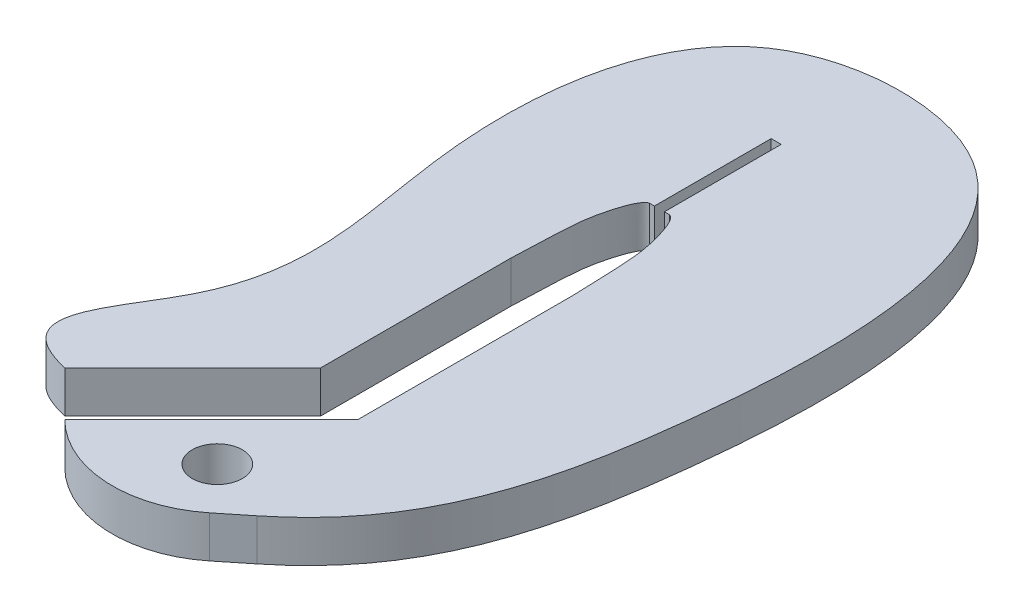
ISO-10303-21;
HEADER;
FILE_DESCRIPTION(('STEP AP214'),'2;1');
FILE_NAME('part.step','',(''),(''),'','','');
FILE_SCHEMA(('AUTOMOTIVE_DESIGN { 1 0 10303 214 1 1 1 1 }'));
ENDSEC;
DATA;
#1=APPLICATION_CONTEXT('core data for automotive mechanical design processes');
#2=APPLICATION_PROTOCOL_DEFINITION('international standard','automotive_design',2000,#1);
#3=PRODUCT_CONTEXT('',#1,'mechanical');
#4=PRODUCT('Part','Part','',(#3));
#5=PRODUCT_RELATED_PRODUCT_CATEGORY('part','',(#4));
#6=PRODUCT_DEFINITION_FORMATION('','',#4);
#7=PRODUCT_DEFINITION_CONTEXT('part definition',#1,'design');
#8=PRODUCT_DEFINITION('design','',#6,#7);
#9=PRODUCT_DEFINITION_SHAPE('','',#8);
#10=(LENGTH_UNIT() NAMED_UNIT(*) SI_UNIT(.MILLI.,.METRE.));
#11=(NAMED_UNIT(*) PLANE_ANGLE_UNIT() SI_UNIT($,.RADIAN.));
#12=(NAMED_UNIT(*) SI_UNIT($,.STERADIAN.) SOLID_ANGLE_UNIT());
#13=UNCERTAINTY_MEASURE_WITH_UNIT(LENGTH_MEASURE(1.E-05),#10,'distance_accuracy_value','');
#14=(GEOMETRIC_REPRESENTATION_CONTEXT(3) GLOBAL_UNCERTAINTY_ASSIGNED_CONTEXT((#13)) GLOBAL_UNIT_ASSIGNED_CONTEXT((#10,
#11,#12)) REPRESENTATION_CONTEXT('',''));
#15=CARTESIAN_POINT('',(0.,0.,0.));
#16=DIRECTION('',(0.,0.,1.));
#17=DIRECTION('',(1.,0.,0.));
#18=AXIS2_PLACEMENT_3D('',#15,#16,#17);
#19=CARTESIAN_POINT('',(4.52631083074093,2.5,-32.3138557168903));
#20=DIRECTION('',(0.,-1.,0.));
#21=DIRECTION('',(0.,0.,-1.));
#22=AXIS2_PLACEMENT_3D('',#19,#20,#21);
#23=PLANE('',#22);
#24=CARTESIAN_POINT('',(6.36765924011729,2.5,8.99126136659441));
#25=CARTESIAN_POINT('',(8.33592128594081,2.5,7.41052972888379));
#26=CARTESIAN_POINT('',(12.4422864625777,2.5,2.47581603232794));
#27=CARTESIAN_POINT('',(15.2743284521628,2.5,-11.3720785952308));
#28=CARTESIAN_POINT('',(15.3995850689258,2.5,-33.1916811091714));
#29=CARTESIAN_POINT('',(-6.20231168166281,2.5,-32.4691182728249));
#30=CARTESIAN_POINT('',(-8.06896636052285,2.5,-15.0563166698078));
#31=CARTESIAN_POINT('',(-3.37106080697065,2.5,-2.76640861666073));
#32=CARTESIAN_POINT('',(-12.0212916162128,2.5,5.93283563216519));
#33=CARTESIAN_POINT('',(-7.07106781186551,2.5,7.07106781186547));
#34=B_SPLINE_CURVE_WITH_KNOTS('',3,(#24,#25,#26,#27,#28,#29,#30,#31,#32,#33),.UNSPECIFIED.,.F.,
.F.,(4,1,1,1,1,1,1,4),(0.0116284680882621,0.0818777860571435,0.220720336560713,
0.462998596925492,0.579337122233019,0.740821042009564,0.900192675539681,1.),.UNSPECIFIED.);
#35=CARTESIAN_POINT('',(6.36765924011806,2.5,8.99126136659412));
#36=VERTEX_POINT('',#35);
#37=CARTESIAN_POINT('',(-7.07106781186547,2.5,7.07106781186547));
#38=VERTEX_POINT('',#37);
#39=EDGE_CURVE('E209',#36,#38,#34,.T.);
#40=ORIENTED_EDGE('',*,*,#39,.T.);
#41=DIRECTION('',(0.707106781186548,0.,-0.707106781186548));
#42=VECTOR('',#41,1.);
#43=CARTESIAN_POINT('',(0.6,2.5,-0.6));
#44=LINE('',#43,#42);
#45=CARTESIAN_POINT('',(0.6,2.5,-0.6));
#46=VERTEX_POINT('',#45);
#47=EDGE_CURVE('E112',#38,#46,#44,.T.);
#48=ORIENTED_EDGE('',*,*,#47,.T.);
#49=DIRECTION('',(0.,0.,-1.));
#50=VECTOR('',#49,1.);
#51=CARTESIAN_POINT('',(0.6,2.5,-0.6));
#52=LINE('',#51,#50);
#53=CARTESIAN_POINT('',(0.6,2.5,-12.));
#54=VERTEX_POINT('',#53);
#55=EDGE_CURVE('E242',#46,#54,#52,.T.);
#56=ORIENTED_EDGE('',*,*,#55,.T.);
#57=CARTESIAN_POINT('',(0.6,2.5,-12.));
#58=CARTESIAN_POINT('',(0.705879385478123,2.5,-15.5317289947273));
#59=CARTESIAN_POINT('',(0.830348083774037,2.5,-16.2001089021));
#60=CARTESIAN_POINT('',(0.963303184907785,2.5,-16.9797649874549));
#61=CARTESIAN_POINT('',(1.42899004008316,2.5,-18.8963341287148));
#62=CARTESIAN_POINT('',(1.9,2.5,-19.));
#63=B_SPLINE_CURVE_WITH_KNOTS('',3,(#57,#58,#59,#60,#61,#62),.UNSPECIFIED.,.F.,.F.,(4,1,1,4),
(0.,0.421520607833675,0.521520607833675,1.),.UNSPECIFIED.);
#64=CARTESIAN_POINT('',(1.9,2.5,-19.));
#65=VERTEX_POINT('',#64);
#66=EDGE_CURVE('E261',#54,#65,#63,.T.);
#67=ORIENTED_EDGE('',*,*,#66,.T.);
#68=DIRECTION('',(1.,0.,0.));
#69=VECTOR('',#68,1.);
#70=CARTESIAN_POINT('',(1.9,2.5,-19.));
#71=LINE('',#70,#69);
#72=CARTESIAN_POINT('',(2.2,2.5,-19.));
#73=VERTEX_POINT('',#72);
#74=EDGE_CURVE('E258',#65,#73,#71,.T.);
#75=ORIENTED_EDGE('',*,*,#74,.T.);
#76=DIRECTION('',(0.,0.,-1.));
#77=VECTOR('',#76,1.);
#78=CARTESIAN_POINT('',(2.2,2.5,-19.));
#79=LINE('',#78,#77);
#80=CARTESIAN_POINT('',(2.2,2.5,-26.));
#81=VERTEX_POINT('',#80);
#82=EDGE_CURVE('E260',#73,#81,#79,.T.);
#83=ORIENTED_EDGE('',*,*,#82,.T.);
#84=DIRECTION('',(1.,0.,0.));
#85=VECTOR('',#84,1.);
#86=CARTESIAN_POINT('',(2.2,2.5,-26.));
#87=LINE('',#86,#85);
#88=CARTESIAN_POINT('',(2.8,2.5,-26.));
#89=VERTEX_POINT('',#88);
#90=EDGE_CURVE('E263',#81,#89,#87,.T.);
#91=ORIENTED_EDGE('',*,*,#90,.T.);
#92=DIRECTION('',(0.,0.,1.));
#93=VECTOR('',#92,1.);
#94=CARTESIAN_POINT('',(2.8,2.5,-19.));
#95=LINE('',#94,#93);
#96=CARTESIAN_POINT('',(2.8,2.5,-19.));
#97=VERTEX_POINT('',#96);
#98=EDGE_CURVE('E272',#89,#97,#95,.T.);
#99=ORIENTED_EDGE('',*,*,#98,.T.);
#100=DIRECTION('',(1.,0.,0.));
#101=VECTOR('',#100,1.);
#102=CARTESIAN_POINT('',(2.8,2.5,-19.));
#103=LINE('',#102,#101);
#104=CARTESIAN_POINT('',(3.1,2.5,-19.));
#105=VERTEX_POINT('',#104);
#106=EDGE_CURVE('E274',#97,#105,#103,.T.);
#107=ORIENTED_EDGE('',*,*,#106,.T.);
#108=CARTESIAN_POINT('',(3.1,2.5,-19.));
#109=CARTESIAN_POINT('',(3.57100995991684,2.5,-18.8963341287148));
#110=CARTESIAN_POINT('',(4.03669681509221,2.5,-16.9797649874549));
#111=CARTESIAN_POINT('',(4.16965191622597,2.5,-16.2001089021));
#112=CARTESIAN_POINT('',(4.29412061452188,2.5,-15.5317289947273));
#113=CARTESIAN_POINT('',(4.4,2.5,-12.));
#114=B_SPLINE_CURVE_WITH_KNOTS('',3,(#108,#109,#110,#111,#112,#113),.UNSPECIFIED.,.F.,.F.,(4,1,
1,4),(0.,0.478479392166325,0.578479392166325,1.),.UNSPECIFIED.);
#115=CARTESIAN_POINT('',(4.4,2.5,-12.));
#116=VERTEX_POINT('',#115);
#117=EDGE_CURVE('E276',#105,#116,#114,.T.);
#118=ORIENTED_EDGE('',*,*,#117,.T.);
#119=DIRECTION('',(0.,0.,1.));
#120=VECTOR('',#119,1.);
#121=CARTESIAN_POINT('',(4.4,2.5,-12.));
#122=LINE('',#121,#120);
#123=CARTESIAN_POINT('',(4.4,2.5,0.974011537017759));
#124=VERTEX_POINT('',#123);
#125=EDGE_CURVE('E149',#116,#124,#122,.T.);
#126=ORIENTED_EDGE('',*,*,#125,.T.);
#127=DIRECTION('',(-0.707106781186547,0.,0.707106781186548));
#128=VECTOR('',#127,1.);
#129=CARTESIAN_POINT('',(4.4,2.5,0.974011537017759));
#130=LINE('',#129,#128);
#131=CARTESIAN_POINT('',(-4.3840620433566,2.5,9.75807358037436));
#132=VERTEX_POINT('',#131);
#133=EDGE_CURVE('E143',#124,#132,#130,.T.);
#134=ORIENTED_EDGE('',*,*,#133,.T.);
#135=CARTESIAN_POINT('',(0.48273519546393,2.5,4.89127634155383));
#136=DIRECTION('',(0.,1.,0.));
#137=DIRECTION('',(0.,0.,1.));
#138=AXIS2_PLACEMENT_3D('',#135,#136,#137);
#139=CIRCLE('',#138,6.88269066045992);
#140=CARTESIAN_POINT('',(4.79788993574044,2.5,10.2532601437535));
#141=VERTEX_POINT('',#140);
#142=EDGE_CURVE('E147',#132,#141,#139,.T.);
#143=ORIENTED_EDGE('',*,*,#142,.T.);
#144=CARTESIAN_POINT('',(1258.71295152405,2.5,1568.36013098587));
#145=DIRECTION('',(0.,-1.,0.));
#146=DIRECTION('',(0.,0.,1.));
#147=AXIS2_PLACEMENT_3D('',#144,#145,#146);
#148=CIRCLE('',#147,2000.00000066085);
#149=EDGE_CURVE('E51',#141,#36,#148,.T.);
#150=ORIENTED_EDGE('',*,*,#149,.T.);
#151=EDGE_LOOP('',(#40,#48,#56,#67,#75,#83,#91,#99,#107,#118,#126,#134,#143,#150));
#152=FACE_BOUND('',#151,.T.);
#153=CARTESIAN_POINT('',(2.5,2.5,7.50000000000001));
#154=DIRECTION('',(0.,1.,0.));
#155=DIRECTION('',(0.,0.,1.));
#156=AXIS2_PLACEMENT_3D('',#153,#154,#155);
#157=CIRCLE('',#156,1.5);
#158=CARTESIAN_POINT('',(2.5,2.5,9.00000000000001));
#159=VERTEX_POINT('',#158);
#160=EDGE_CURVE('E173',#159,#159,#157,.T.);
#161=ORIENTED_EDGE('',*,*,#160,.F.);
#162=EDGE_LOOP('',(#161));
#163=FACE_BOUND('',#162,.T.);
#164=ADVANCED_FACE('F33',(#152,#163),#23,.F.);
#165=CARTESIAN_POINT('',(4.52631083074093,0.,-32.3138557168903));
#166=DIRECTION('',(0.,-1.,0.));
#167=DIRECTION('',(0.,0.,-1.));
#168=AXIS2_PLACEMENT_3D('',#165,#166,#167);
#169=PLANE('',#168);
#170=CARTESIAN_POINT('',(6.36765924011729,0.,8.99126136659441));
#171=CARTESIAN_POINT('',(8.33592128594081,0.,7.41052972888379));
#172=CARTESIAN_POINT('',(12.4422864625777,0.,2.47581603232794));
#173=CARTESIAN_POINT('',(15.2743284521628,0.,-11.3720785952308));
#174=CARTESIAN_POINT('',(15.3995850689258,0.,-33.1916811091714));
#175=CARTESIAN_POINT('',(-6.20231168166281,0.,-32.4691182728249));
#176=CARTESIAN_POINT('',(-8.06896636052285,0.,-15.0563166698078));
#177=CARTESIAN_POINT('',(-3.37106080697065,0.,-2.76640861666073));
#178=CARTESIAN_POINT('',(-12.0212916162128,0.,5.93283563216519));
#179=CARTESIAN_POINT('',(-7.07106781186551,0.,7.07106781186547));
#180=B_SPLINE_CURVE_WITH_KNOTS('',3,(#170,#171,#172,#173,#174,#175,#176,#177,#178,#179),
.UNSPECIFIED.,.F.,.F.,(4,1,1,1,1,1,1,4),(0.0116284680882621,0.0818777860571435,
0.220720336560713,0.462998596925492,0.579337122233019,0.740821042009564,0.900192675539681,1.),.UNSPECIFIED.);
#181=CARTESIAN_POINT('',(6.36765924011806,0.,8.99126136659412));
#182=VERTEX_POINT('',#181);
#183=CARTESIAN_POINT('',(-7.07106781186547,0.,7.07106781186547));
#184=VERTEX_POINT('',#183);
#185=EDGE_CURVE('E167',#182,#184,#180,.T.);
#186=ORIENTED_EDGE('',*,*,#185,.F.);
#187=CARTESIAN_POINT('',(1258.71295152405,0.,1568.36013098587));
#188=DIRECTION('',(0.,-1.,0.));
#189=DIRECTION('',(0.,0.,1.));
#190=AXIS2_PLACEMENT_3D('',#187,#188,#189);
#191=CIRCLE('',#190,2000.00000066085);
#192=CARTESIAN_POINT('',(4.79788993574044,0.,10.2532601437535));
#193=VERTEX_POINT('',#192);
#194=EDGE_CURVE('E104',#193,#182,#191,.T.);
#195=ORIENTED_EDGE('',*,*,#194,.F.);
#196=CARTESIAN_POINT('',(0.48273519546393,0.,4.89127634155383));
#197=DIRECTION('',(0.,1.,0.));
#198=DIRECTION('',(0.,0.,1.));
#199=AXIS2_PLACEMENT_3D('',#196,#197,#198);
#200=CIRCLE('',#199,6.88269066045992);
#201=CARTESIAN_POINT('',(-4.3840620433566,0.,9.75807358037436));
#202=VERTEX_POINT('',#201);
#203=EDGE_CURVE('E98',#202,#193,#200,.T.);
#204=ORIENTED_EDGE('',*,*,#203,.F.);
#205=DIRECTION('',(-0.707106781186547,0.,0.707106781186548));
#206=VECTOR('',#205,1.);
#207=CARTESIAN_POINT('',(4.4,0.,0.974011537017759));
#208=LINE('',#207,#206);
#209=CARTESIAN_POINT('',(4.4,0.,0.974011537017759));
#210=VERTEX_POINT('',#209);
#211=EDGE_CURVE('E157',#210,#202,#208,.T.);
#212=ORIENTED_EDGE('',*,*,#211,.F.);
#213=DIRECTION('',(0.,0.,1.));
#214=VECTOR('',#213,1.);
#215=CARTESIAN_POINT('',(4.4,0.,-12.));
#216=LINE('',#215,#214);
#217=CARTESIAN_POINT('',(4.4,0.,-12.));
#218=VERTEX_POINT('',#217);
#219=EDGE_CURVE('E201',#218,#210,#216,.T.);
#220=ORIENTED_EDGE('',*,*,#219,.F.);
#221=CARTESIAN_POINT('',(3.1,0.,-19.));
#222=CARTESIAN_POINT('',(3.57100995991684,0.,-18.8963341287148));
#223=CARTESIAN_POINT('',(4.03669681509221,0.,-16.9797649874549));
#224=CARTESIAN_POINT('',(4.16965191622597,0.,-16.2001089021));
#225=CARTESIAN_POINT('',(4.29412061452188,0.,-15.5317289947273));
#226=CARTESIAN_POINT('',(4.4,0.,-12.));
#227=B_SPLINE_CURVE_WITH_KNOTS('',3,(#221,#222,#223,#224,#225,#226),.UNSPECIFIED.,.F.,.F.,(4,1,
1,4),(0.,0.478479392166325,0.578479392166325,1.),.UNSPECIFIED.);
#228=CARTESIAN_POINT('',(3.1,0.,-19.));
#229=VERTEX_POINT('',#228);
#230=EDGE_CURVE('E197',#229,#218,#227,.T.);
#231=ORIENTED_EDGE('',*,*,#230,.F.);
#232=DIRECTION('',(1.,0.,0.));
#233=VECTOR('',#232,1.);
#234=CARTESIAN_POINT('',(2.8,0.,-19.));
#235=LINE('',#234,#233);
#236=CARTESIAN_POINT('',(2.8,0.,-19.));
#237=VERTEX_POINT('',#236);
#238=EDGE_CURVE('E195',#237,#229,#235,.T.);
#239=ORIENTED_EDGE('',*,*,#238,.F.);
#240=DIRECTION('',(0.,0.,1.));
#241=VECTOR('',#240,1.);
#242=CARTESIAN_POINT('',(2.8,0.,-19.));
#243=LINE('',#242,#241);
#244=CARTESIAN_POINT('',(2.8,0.,-26.));
#245=VERTEX_POINT('',#244);
#246=EDGE_CURVE('E193',#245,#237,#243,.T.);
#247=ORIENTED_EDGE('',*,*,#246,.F.);
#248=DIRECTION('',(1.,0.,0.));
#249=VECTOR('',#248,1.);
#250=CARTESIAN_POINT('',(2.2,0.,-26.));
#251=LINE('',#250,#249);
#252=CARTESIAN_POINT('',(2.2,0.,-26.));
#253=VERTEX_POINT('',#252);
#254=EDGE_CURVE('E191',#253,#245,#251,.T.);
#255=ORIENTED_EDGE('',*,*,#254,.F.);
#256=DIRECTION('',(0.,0.,-1.));
#257=VECTOR('',#256,1.);
#258=CARTESIAN_POINT('',(2.2,0.,-19.));
#259=LINE('',#258,#257);
#260=CARTESIAN_POINT('',(2.2,0.,-19.));
#261=VERTEX_POINT('',#260);
#262=EDGE_CURVE('E189',#261,#253,#259,.T.);
#263=ORIENTED_EDGE('',*,*,#262,.F.);
#264=DIRECTION('',(1.,0.,0.));
#265=VECTOR('',#264,1.);
#266=CARTESIAN_POINT('',(1.9,0.,-19.));
#267=LINE('',#266,#265);
#268=CARTESIAN_POINT('',(1.9,0.,-19.));
#269=VERTEX_POINT('',#268);
#270=EDGE_CURVE('E184',#269,#261,#267,.T.);
#271=ORIENTED_EDGE('',*,*,#270,.F.);
#272=CARTESIAN_POINT('',(0.6,0.,-12.));
#273=CARTESIAN_POINT('',(0.705879385478123,0.,-15.5317289947273));
#274=CARTESIAN_POINT('',(0.830348083774037,0.,-16.2001089021));
#275=CARTESIAN_POINT('',(0.963303184907785,0.,-16.9797649874549));
#276=CARTESIAN_POINT('',(1.42899004008316,0.,-18.8963341287148));
#277=CARTESIAN_POINT('',(1.9,0.,-19.));
#278=B_SPLINE_CURVE_WITH_KNOTS('',3,(#272,#273,#274,#275,#276,#277),.UNSPECIFIED.,.F.,.F.,(4,1,
1,4),(0.,0.421520607833675,0.521520607833675,1.),.UNSPECIFIED.);
#279=CARTESIAN_POINT('',(0.6,0.,-12.));
#280=VERTEX_POINT('',#279);
#281=EDGE_CURVE('E180',#280,#269,#278,.T.);
#282=ORIENTED_EDGE('',*,*,#281,.F.);
#283=DIRECTION('',(0.,0.,-1.));
#284=VECTOR('',#283,1.);
#285=CARTESIAN_POINT('',(0.6,0.,-0.6));
#286=LINE('',#285,#284);
#287=CARTESIAN_POINT('',(0.6,0.,-0.6));
#288=VERTEX_POINT('',#287);
#289=EDGE_CURVE('E178',#288,#280,#286,.T.);
#290=ORIENTED_EDGE('',*,*,#289,.F.);
#291=DIRECTION('',(0.707106781186548,0.,-0.707106781186548));
#292=VECTOR('',#291,1.);
#293=CARTESIAN_POINT('',(0.6,0.,-0.6));
#294=LINE('',#293,#292);
#295=EDGE_CURVE('E172',#184,#288,#294,.T.);
#296=ORIENTED_EDGE('',*,*,#295,.F.);
#297=EDGE_LOOP('',(#186,#195,#204,#212,#220,#231,#239,#247,#255,#263,#271,#282,#290,#296));
#298=FACE_BOUND('',#297,.T.);
#299=CARTESIAN_POINT('',(2.5,0.,7.50000000000001));
#300=DIRECTION('',(0.,1.,0.));
#301=DIRECTION('',(0.,0.,1.));
#302=AXIS2_PLACEMENT_3D('',#299,#300,#301);
#303=CIRCLE('',#302,1.5);
#304=CARTESIAN_POINT('',(2.5,0.,9.00000000000001));
#305=VERTEX_POINT('',#304);
#306=EDGE_CURVE('E348',#305,#305,#303,.T.);
#307=ORIENTED_EDGE('',*,*,#306,.T.);
#308=EDGE_LOOP('',(#307));
#309=FACE_BOUND('',#308,.T.);
#310=ADVANCED_FACE('F246',(#298,#309),#169,.T.);
#311=DIRECTION('',(0.,-1.,0.));
#312=VECTOR('',#311,1.);
#313=SURFACE_OF_LINEAR_EXTRUSION('',#34,#312);
#314=ORIENTED_EDGE('',*,*,#185,.T.);
#315=DIRECTION('',(0.,-1.,0.));
#316=VECTOR('',#315,1.);
#317=CARTESIAN_POINT('',(-7.07106781186547,2.5,7.07106781186547));
#318=LINE('',#317,#316);
#319=EDGE_CURVE('E11',#38,#184,#318,.T.);
#320=ORIENTED_EDGE('',*,*,#319,.F.);
#321=ORIENTED_EDGE('',*,*,#39,.F.);
#322=DIRECTION('',(0.,-1.,0.));
#323=VECTOR('',#322,1.);
#324=CARTESIAN_POINT('',(6.36765924011806,2.5,8.99126136659412));
#325=LINE('',#324,#323);
#326=EDGE_CURVE('E163',#36,#182,#325,.T.);
#327=ORIENTED_EDGE('',*,*,#326,.T.);
#328=EDGE_LOOP('',(#314,#320,#321,#327));
#329=FACE_BOUND('',#328,.T.);
#330=ADVANCED_FACE('F35',(#329),#313,.F.);
#331=CARTESIAN_POINT('',(0.6,2.5,-0.6));
#332=DIRECTION('',(-0.707106781186548,0.,-0.707106781186548));
#333=DIRECTION('',(-0.707106781186548,0.,0.707106781186548));
#334=AXIS2_PLACEMENT_3D('',#331,#332,#333);
#335=PLANE('',#334);
#336=ORIENTED_EDGE('',*,*,#295,.T.);
#337=DIRECTION('',(0.,-1.,0.));
#338=VECTOR('',#337,1.);
#339=CARTESIAN_POINT('',(0.6,2.5,-0.6));
#340=LINE('',#339,#338);
#341=EDGE_CURVE('E43',#46,#288,#340,.T.);
#342=ORIENTED_EDGE('',*,*,#341,.F.);
#343=ORIENTED_EDGE('',*,*,#47,.F.);
#344=ORIENTED_EDGE('',*,*,#319,.T.);
#345=EDGE_LOOP('',(#336,#342,#343,#344));
#346=FACE_BOUND('',#345,.T.);
#347=ADVANCED_FACE('F312',(#346),#335,.F.);
#348=CARTESIAN_POINT('',(0.6,2.5,-0.6));
#349=DIRECTION('',(-1.,0.,0.));
#350=DIRECTION('',(0.,0.,1.));
#351=AXIS2_PLACEMENT_3D('',#348,#349,#350);
#352=PLANE('',#351);
#353=ORIENTED_EDGE('',*,*,#289,.T.);
#354=DIRECTION('',(0.,-1.,0.));
#355=VECTOR('',#354,1.);
#356=CARTESIAN_POINT('',(0.6,2.5,-12.));
#357=LINE('',#356,#355);
#358=EDGE_CURVE('E234',#54,#280,#357,.T.);
#359=ORIENTED_EDGE('',*,*,#358,.F.);
#360=ORIENTED_EDGE('',*,*,#55,.F.);
#361=ORIENTED_EDGE('',*,*,#341,.T.);
#362=EDGE_LOOP('',(#353,#359,#360,#361));
#363=FACE_BOUND('',#362,.T.);
#364=ADVANCED_FACE('F240',(#363),#352,.F.);
#365=DIRECTION('',(0.,-1.,0.));
#366=VECTOR('',#365,1.);
#367=SURFACE_OF_LINEAR_EXTRUSION('',#63,#366);
#368=ORIENTED_EDGE('',*,*,#281,.T.);
#369=DIRECTION('',(0.,-1.,0.));
#370=VECTOR('',#369,1.);
#371=CARTESIAN_POINT('',(1.9,2.5,-19.));
#372=LINE('',#371,#370);
#373=EDGE_CURVE('E231',#65,#269,#372,.T.);
#374=ORIENTED_EDGE('',*,*,#373,.F.);
#375=ORIENTED_EDGE('',*,*,#66,.F.);
#376=ORIENTED_EDGE('',*,*,#358,.T.);
#377=EDGE_LOOP('',(#368,#374,#375,#376));
#378=FACE_BOUND('',#377,.T.);
#379=ADVANCED_FACE('F252',(#378),#367,.F.);
#380=CARTESIAN_POINT('',(1.9,2.5,-19.));
#381=DIRECTION('',(0.,0.,-1.));
#382=DIRECTION('',(-1.,0.,0.));
#383=AXIS2_PLACEMENT_3D('',#380,#381,#382);
#384=PLANE('',#383);
#385=ORIENTED_EDGE('',*,*,#270,.T.);
#386=DIRECTION('',(0.,-1.,0.));
#387=VECTOR('',#386,1.);
#388=CARTESIAN_POINT('',(2.2,2.5,-19.));
#389=LINE('',#388,#387);
#390=EDGE_CURVE('E228',#73,#261,#389,.T.);
#391=ORIENTED_EDGE('',*,*,#390,.F.);
#392=ORIENTED_EDGE('',*,*,#74,.F.);
#393=ORIENTED_EDGE('',*,*,#373,.T.);
#394=EDGE_LOOP('',(#385,#391,#392,#393));
#395=FACE_BOUND('',#394,.T.);
#396=ADVANCED_FACE('F256',(#395),#384,.F.);
#397=CARTESIAN_POINT('',(2.2,2.5,-19.));
#398=DIRECTION('',(-1.,0.,0.));
#399=DIRECTION('',(0.,0.,1.));
#400=AXIS2_PLACEMENT_3D('',#397,#398,#399);
#401=PLANE('',#400);
#402=ORIENTED_EDGE('',*,*,#262,.T.);
#403=DIRECTION('',(0.,-1.,0.));
#404=VECTOR('',#403,1.);
#405=CARTESIAN_POINT('',(2.2,2.5,-26.));
#406=LINE('',#405,#404);
#407=EDGE_CURVE('E225',#81,#253,#406,.T.);
#408=ORIENTED_EDGE('',*,*,#407,.F.);
#409=ORIENTED_EDGE('',*,*,#82,.F.);
#410=ORIENTED_EDGE('',*,*,#390,.T.);
#411=EDGE_LOOP('',(#402,#408,#409,#410));
#412=FACE_BOUND('',#411,.T.);
#413=ADVANCED_FACE('F302',(#412),#401,.F.);
#414=CARTESIAN_POINT('',(2.2,2.5,-26.));
#415=DIRECTION('',(0.,0.,-1.));
#416=DIRECTION('',(-1.,0.,0.));
#417=AXIS2_PLACEMENT_3D('',#414,#415,#416);
#418=PLANE('',#417);
#419=ORIENTED_EDGE('',*,*,#254,.T.);
#420=DIRECTION('',(0.,-1.,0.));
#421=VECTOR('',#420,1.);
#422=CARTESIAN_POINT('',(2.8,2.5,-26.));
#423=LINE('',#422,#421);
#424=EDGE_CURVE('E222',#89,#245,#423,.T.);
#425=ORIENTED_EDGE('',*,*,#424,.F.);
#426=ORIENTED_EDGE('',*,*,#90,.F.);
#427=ORIENTED_EDGE('',*,*,#407,.T.);
#428=EDGE_LOOP('',(#419,#425,#426,#427));
#429=FACE_BOUND('',#428,.T.);
#430=ADVANCED_FACE('F298',(#429),#418,.F.);
#431=CARTESIAN_POINT('',(2.8,2.5,-19.));
#432=DIRECTION('',(1.,0.,0.));
#433=DIRECTION('',(0.,0.,-1.));
#434=AXIS2_PLACEMENT_3D('',#431,#432,#433);
#435=PLANE('',#434);
#436=ORIENTED_EDGE('',*,*,#246,.T.);
#437=DIRECTION('',(0.,-1.,0.));
#438=VECTOR('',#437,1.);
#439=CARTESIAN_POINT('',(2.8,2.5,-19.));
#440=LINE('',#439,#438);
#441=EDGE_CURVE('E219',#97,#237,#440,.T.);
#442=ORIENTED_EDGE('',*,*,#441,.F.);
#443=ORIENTED_EDGE('',*,*,#98,.F.);
#444=ORIENTED_EDGE('',*,*,#424,.T.);
#445=EDGE_LOOP('',(#436,#442,#443,#444));
#446=FACE_BOUND('',#445,.T.);
#447=ADVANCED_FACE('F294',(#446),#435,.F.);
#448=CARTESIAN_POINT('',(2.8,2.5,-19.));
#449=DIRECTION('',(0.,0.,-1.));
#450=DIRECTION('',(-1.,0.,0.));
#451=AXIS2_PLACEMENT_3D('',#448,#449,#450);
#452=PLANE('',#451);
#453=ORIENTED_EDGE('',*,*,#238,.T.);
#454=DIRECTION('',(0.,-1.,0.));
#455=VECTOR('',#454,1.);
#456=CARTESIAN_POINT('',(3.1,2.5,-19.));
#457=LINE('',#456,#455);
#458=EDGE_CURVE('E216',#105,#229,#457,.T.);
#459=ORIENTED_EDGE('',*,*,#458,.F.);
#460=ORIENTED_EDGE('',*,*,#106,.F.);
#461=ORIENTED_EDGE('',*,*,#441,.T.);
#462=EDGE_LOOP('',(#453,#459,#460,#461));
#463=FACE_BOUND('',#462,.T.);
#464=ADVANCED_FACE('F289',(#463),#452,.F.);
#465=DIRECTION('',(0.,-1.,0.));
#466=VECTOR('',#465,1.);
#467=SURFACE_OF_LINEAR_EXTRUSION('',#114,#466);
#468=ORIENTED_EDGE('',*,*,#230,.T.);
#469=DIRECTION('',(0.,-1.,0.));
#470=VECTOR('',#469,1.);
#471=CARTESIAN_POINT('',(4.4,2.5,-12.));
#472=LINE('',#471,#470);
#473=EDGE_CURVE('E213',#116,#218,#472,.T.);
#474=ORIENTED_EDGE('',*,*,#473,.F.);
#475=ORIENTED_EDGE('',*,*,#117,.F.);
#476=ORIENTED_EDGE('',*,*,#458,.T.);
#477=EDGE_LOOP('',(#468,#474,#475,#476));
#478=FACE_BOUND('',#477,.T.);
#479=ADVANCED_FACE('F284',(#478),#467,.F.);
#480=CARTESIAN_POINT('',(4.4,2.5,-12.));
#481=DIRECTION('',(1.,0.,0.));
#482=DIRECTION('',(0.,0.,-1.));
#483=AXIS2_PLACEMENT_3D('',#480,#481,#482);
#484=PLANE('',#483);
#485=ORIENTED_EDGE('',*,*,#219,.T.);
#486=DIRECTION('',(0.,-1.,0.));
#487=VECTOR('',#486,1.);
#488=CARTESIAN_POINT('',(4.4,2.5,0.974011537017759));
#489=LINE('',#488,#487);
#490=EDGE_CURVE('E158',#124,#210,#489,.T.);
#491=ORIENTED_EDGE('',*,*,#490,.F.);
#492=ORIENTED_EDGE('',*,*,#125,.F.);
#493=ORIENTED_EDGE('',*,*,#473,.T.);
#494=EDGE_LOOP('',(#485,#491,#492,#493));
#495=FACE_BOUND('',#494,.T.);
#496=ADVANCED_FACE('F288',(#495),#484,.F.);
#497=CARTESIAN_POINT('',(4.4,2.5,0.974011537017759));
#498=DIRECTION('',(0.707106781186548,0.,0.707106781186547));
#499=DIRECTION('',(0.707106781186547,0.,-0.707106781186548));
#500=AXIS2_PLACEMENT_3D('',#497,#498,#499);
#501=PLANE('',#500);
#502=ORIENTED_EDGE('',*,*,#211,.T.);
#503=DIRECTION('',(0.,-1.,0.));
#504=VECTOR('',#503,1.);
#505=CARTESIAN_POINT('',(-4.3840620433566,2.5,9.75807358037436));
#506=LINE('',#505,#504);
#507=EDGE_CURVE('E154',#132,#202,#506,.T.);
#508=ORIENTED_EDGE('',*,*,#507,.F.);
#509=ORIENTED_EDGE('',*,*,#133,.F.);
#510=ORIENTED_EDGE('',*,*,#490,.T.);
#511=EDGE_LOOP('',(#502,#508,#509,#510));
#512=FACE_BOUND('',#511,.T.);
#513=ADVANCED_FACE('F155',(#512),#501,.F.);
#514=CARTESIAN_POINT('',(0.48273519546393,2.5,4.89127634155383));
#515=DIRECTION('',(0.,-1.,0.));
#516=DIRECTION('',(0.,0.,-1.));
#517=AXIS2_PLACEMENT_3D('',#514,#515,#516);
#518=CYLINDRICAL_SURFACE('',#517,6.88269066045992);
#519=ORIENTED_EDGE('',*,*,#203,.T.);
#520=DIRECTION('',(0.,-1.,0.));
#521=VECTOR('',#520,1.);
#522=CARTESIAN_POINT('',(4.79788993574044,2.5,10.2532601437535));
#523=LINE('',#522,#521);
#524=EDGE_CURVE('E159',#141,#193,#523,.T.);
#525=ORIENTED_EDGE('',*,*,#524,.F.);
#526=ORIENTED_EDGE('',*,*,#142,.F.);
#527=ORIENTED_EDGE('',*,*,#507,.T.);
#528=EDGE_LOOP('',(#519,#525,#526,#527));
#529=FACE_BOUND('',#528,.T.);
#530=ADVANCED_FACE('F161',(#529),#518,.T.);
#531=CARTESIAN_POINT('',(1258.71295152405,2.5,1568.36013098587));
#532=DIRECTION('',(0.,-1.,0.));
#533=DIRECTION('',(0.,0.,-1.));
#534=AXIS2_PLACEMENT_3D('',#531,#532,#533);
#535=CYLINDRICAL_SURFACE('',#534,2000.00000066085);
#536=ORIENTED_EDGE('',*,*,#194,.T.);
#537=ORIENTED_EDGE('',*,*,#326,.F.);
#538=ORIENTED_EDGE('',*,*,#149,.F.);
#539=ORIENTED_EDGE('',*,*,#524,.T.);
#540=EDGE_LOOP('',(#536,#537,#538,#539));
#541=FACE_BOUND('',#540,.T.);
#542=ADVANCED_FACE('F327',(#541),#535,.F.);
#543=CARTESIAN_POINT('',(2.5,2.5,7.50000000000001));
#544=DIRECTION('',(0.,-1.,0.));
#545=DIRECTION('',(0.,0.,-1.));
#546=AXIS2_PLACEMENT_3D('',#543,#544,#545);
#547=CYLINDRICAL_SURFACE('',#546,1.5);
#548=ORIENTED_EDGE('',*,*,#160,.T.);
#549=EDGE_LOOP('',(#548));
#550=FACE_BOUND('',#549,.T.);
#551=ORIENTED_EDGE('',*,*,#306,.F.);
#552=EDGE_LOOP('',(#551));
#553=FACE_BOUND('',#552,.T.);
#554=ADVANCED_FACE('F325',(#550,#553),#547,.F.);
#555=CLOSED_SHELL('',(#164,#310,#330,#347,#364,#379,#396,#413,#430,#447,#464,#479,#496,#513,
#530,#542,#554));
#556=MANIFOLD_SOLID_BREP('B2',#555);
#557=ADVANCED_BREP_SHAPE_REPRESENTATION('',(#18,#556),#14);
#558=SHAPE_DEFINITION_REPRESENTATION(#9,#557);
ENDSEC;
END-ISO-10303-21;
